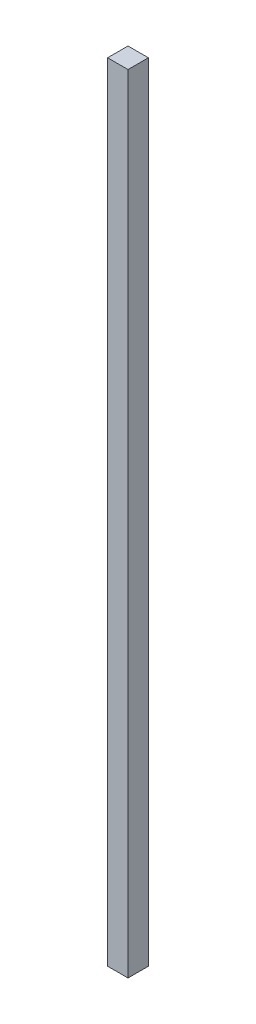
ISO-10303-21;
HEADER;
FILE_DESCRIPTION(('STEP AP214'),'2;1');
FILE_NAME('part.step','',(''),(''),'','','');
FILE_SCHEMA(('AUTOMOTIVE_DESIGN { 1 0 10303 214 1 1 1 1 }'));
ENDSEC;
DATA;
#1=APPLICATION_CONTEXT('core data for automotive mechanical design processes');
#2=APPLICATION_PROTOCOL_DEFINITION('international standard','automotive_design',2000,#1);
#3=PRODUCT_CONTEXT('',#1,'mechanical');
#4=PRODUCT('Part','Part','',(#3));
#5=PRODUCT_RELATED_PRODUCT_CATEGORY('part','',(#4));
#6=PRODUCT_DEFINITION_FORMATION('','',#4);
#7=PRODUCT_DEFINITION_CONTEXT('part definition',#1,'design');
#8=PRODUCT_DEFINITION('design','',#6,#7);
#9=PRODUCT_DEFINITION_SHAPE('','',#8);
#10=(LENGTH_UNIT() NAMED_UNIT(*) SI_UNIT(.MILLI.,.METRE.));
#11=(NAMED_UNIT(*) PLANE_ANGLE_UNIT() SI_UNIT($,.RADIAN.));
#12=(NAMED_UNIT(*) SI_UNIT($,.STERADIAN.) SOLID_ANGLE_UNIT());
#13=UNCERTAINTY_MEASURE_WITH_UNIT(LENGTH_MEASURE(1.E-05),#10,'distance_accuracy_value','');
#14=(GEOMETRIC_REPRESENTATION_CONTEXT(3) GLOBAL_UNCERTAINTY_ASSIGNED_CONTEXT((#13)) GLOBAL_UNIT_ASSIGNED_CONTEXT((#10,
#11,#12)) REPRESENTATION_CONTEXT('',''));
#15=CARTESIAN_POINT('',(0.,0.,0.));
#16=DIRECTION('',(0.,0.,1.));
#17=DIRECTION('',(1.,0.,0.));
#18=AXIS2_PLACEMENT_3D('',#15,#16,#17);
#19=CARTESIAN_POINT('',(0.,463.,0.));
#20=DIRECTION('',(1.,0.,0.));
#21=DIRECTION('',(0.,0.,-1.));
#22=AXIS2_PLACEMENT_3D('',#19,#20,#21);
#23=PLANE('',#22);
#24=DIRECTION('',(0.,0.,1.));
#25=VECTOR('',#24,1.);
#26=CARTESIAN_POINT('',(0.,0.,0.));
#27=LINE('',#26,#25);
#28=CARTESIAN_POINT('',(0.,0.,-12.));
#29=VERTEX_POINT('',#28);
#30=CARTESIAN_POINT('',(0.,0.,0.));
#31=VERTEX_POINT('',#30);
#32=EDGE_CURVE('E96',#29,#31,#27,.T.);
#33=ORIENTED_EDGE('',*,*,#32,.T.);
#34=DIRECTION('',(0.,-1.,0.));
#35=VECTOR('',#34,1.);
#36=CARTESIAN_POINT('',(0.,463.,0.));
#37=LINE('',#36,#35);
#38=CARTESIAN_POINT('',(0.,463.,0.));
#39=VERTEX_POINT('',#38);
#40=EDGE_CURVE('E11',#39,#31,#37,.T.);
#41=ORIENTED_EDGE('',*,*,#40,.F.);
#42=DIRECTION('',(0.,0.,1.));
#43=VECTOR('',#42,1.);
#44=CARTESIAN_POINT('',(0.,463.,0.));
#45=LINE('',#44,#43);
#46=CARTESIAN_POINT('',(0.,463.,-12.));
#47=VERTEX_POINT('',#46);
#48=EDGE_CURVE('E84',#47,#39,#45,.T.);
#49=ORIENTED_EDGE('',*,*,#48,.F.);
#50=DIRECTION('',(0.,-1.,0.));
#51=VECTOR('',#50,1.);
#52=CARTESIAN_POINT('',(0.,463.,-12.));
#53=LINE('',#52,#51);
#54=EDGE_CURVE('E92',#47,#29,#53,.T.);
#55=ORIENTED_EDGE('',*,*,#54,.T.);
#56=EDGE_LOOP('',(#33,#41,#49,#55));
#57=FACE_BOUND('',#56,.T.);
#58=ADVANCED_FACE('F33',(#57),#23,.F.);
#59=CARTESIAN_POINT('',(0.,463.,0.));
#60=DIRECTION('',(0.,0.,-1.));
#61=DIRECTION('',(-1.,0.,0.));
#62=AXIS2_PLACEMENT_3D('',#59,#60,#61);
#63=PLANE('',#62);
#64=DIRECTION('',(1.,0.,0.));
#65=VECTOR('',#64,1.);
#66=CARTESIAN_POINT('',(0.,0.,0.));
#67=LINE('',#66,#65);
#68=CARTESIAN_POINT('',(12.,0.,0.));
#69=VERTEX_POINT('',#68);
#70=EDGE_CURVE('E88',#31,#69,#67,.T.);
#71=ORIENTED_EDGE('',*,*,#70,.T.);
#72=DIRECTION('',(0.,-1.,0.));
#73=VECTOR('',#72,1.);
#74=CARTESIAN_POINT('',(12.,463.,0.));
#75=LINE('',#74,#73);
#76=CARTESIAN_POINT('',(12.,463.,0.));
#77=VERTEX_POINT('',#76);
#78=EDGE_CURVE('E41',#77,#69,#75,.T.);
#79=ORIENTED_EDGE('',*,*,#78,.F.);
#80=DIRECTION('',(1.,0.,0.));
#81=VECTOR('',#80,1.);
#82=CARTESIAN_POINT('',(0.,463.,0.));
#83=LINE('',#82,#81);
#84=EDGE_CURVE('E79',#39,#77,#83,.T.);
#85=ORIENTED_EDGE('',*,*,#84,.F.);
#86=ORIENTED_EDGE('',*,*,#40,.T.);
#87=EDGE_LOOP('',(#71,#79,#85,#86));
#88=FACE_BOUND('',#87,.T.);
#89=ADVANCED_FACE('F87',(#88),#63,.F.);
#90=CARTESIAN_POINT('',(12.,463.,0.));
#91=DIRECTION('',(-1.,0.,0.));
#92=DIRECTION('',(0.,0.,1.));
#93=AXIS2_PLACEMENT_3D('',#90,#91,#92);
#94=PLANE('',#93);
#95=DIRECTION('',(0.,0.,-1.));
#96=VECTOR('',#95,1.);
#97=CARTESIAN_POINT('',(12.,0.,0.));
#98=LINE('',#97,#96);
#99=CARTESIAN_POINT('',(12.,0.,-12.));
#100=VERTEX_POINT('',#99);
#101=EDGE_CURVE('E66',#69,#100,#98,.T.);
#102=ORIENTED_EDGE('',*,*,#101,.T.);
#103=DIRECTION('',(0.,-1.,0.));
#104=VECTOR('',#103,1.);
#105=CARTESIAN_POINT('',(12.,463.,-12.));
#106=LINE('',#105,#104);
#107=CARTESIAN_POINT('',(12.,463.,-12.));
#108=VERTEX_POINT('',#107);
#109=EDGE_CURVE('E89',#108,#100,#106,.T.);
#110=ORIENTED_EDGE('',*,*,#109,.F.);
#111=DIRECTION('',(0.,0.,-1.));
#112=VECTOR('',#111,1.);
#113=CARTESIAN_POINT('',(12.,463.,0.));
#114=LINE('',#113,#112);
#115=EDGE_CURVE('E82',#77,#108,#114,.T.);
#116=ORIENTED_EDGE('',*,*,#115,.F.);
#117=ORIENTED_EDGE('',*,*,#78,.T.);
#118=EDGE_LOOP('',(#102,#110,#116,#117));
#119=FACE_BOUND('',#118,.T.);
#120=ADVANCED_FACE('F90',(#119),#94,.F.);
#121=CARTESIAN_POINT('',(0.,463.,-12.));
#122=DIRECTION('',(0.,0.,1.));
#123=DIRECTION('',(1.,0.,0.));
#124=AXIS2_PLACEMENT_3D('',#121,#122,#123);
#125=PLANE('',#124);
#126=DIRECTION('',(-1.,0.,0.));
#127=VECTOR('',#126,1.);
#128=CARTESIAN_POINT('',(0.,0.,-12.));
#129=LINE('',#128,#127);
#130=EDGE_CURVE('E72',#100,#29,#129,.T.);
#131=ORIENTED_EDGE('',*,*,#130,.T.);
#132=ORIENTED_EDGE('',*,*,#54,.F.);
#133=DIRECTION('',(-1.,0.,0.));
#134=VECTOR('',#133,1.);
#135=CARTESIAN_POINT('',(0.,463.,-12.));
#136=LINE('',#135,#134);
#137=EDGE_CURVE('E49',#108,#47,#136,.T.);
#138=ORIENTED_EDGE('',*,*,#137,.F.);
#139=ORIENTED_EDGE('',*,*,#109,.T.);
#140=EDGE_LOOP('',(#131,#132,#138,#139));
#141=FACE_BOUND('',#140,.T.);
#142=ADVANCED_FACE('F103',(#141),#125,.F.);
#143=CARTESIAN_POINT('',(0.,463.,0.));
#144=DIRECTION('',(0.,-1.,0.));
#145=DIRECTION('',(0.,0.,-1.));
#146=AXIS2_PLACEMENT_3D('',#143,#144,#145);
#147=PLANE('',#146);
#148=ORIENTED_EDGE('',*,*,#48,.T.);
#149=ORIENTED_EDGE('',*,*,#84,.T.);
#150=ORIENTED_EDGE('',*,*,#115,.T.);
#151=ORIENTED_EDGE('',*,*,#137,.T.);
#152=EDGE_LOOP('',(#148,#149,#150,#151));
#153=FACE_BOUND('',#152,.T.);
#154=ADVANCED_FACE('F80',(#153),#147,.F.);
#155=CARTESIAN_POINT('',(0.,0.,0.));
#156=DIRECTION('',(0.,-1.,0.));
#157=DIRECTION('',(0.,0.,-1.));
#158=AXIS2_PLACEMENT_3D('',#155,#156,#157);
#159=PLANE('',#158);
#160=ORIENTED_EDGE('',*,*,#32,.F.);
#161=ORIENTED_EDGE('',*,*,#130,.F.);
#162=ORIENTED_EDGE('',*,*,#101,.F.);
#163=ORIENTED_EDGE('',*,*,#70,.F.);
#164=EDGE_LOOP('',(#160,#161,#162,#163));
#165=FACE_BOUND('',#164,.T.);
#166=ADVANCED_FACE('F106',(#165),#159,.T.);
#167=CLOSED_SHELL('',(#58,#89,#120,#142,#154,#166));
#168=MANIFOLD_SOLID_BREP('B2',#167);
#169=ADVANCED_BREP_SHAPE_REPRESENTATION('',(#18,#168),#14);
#170=SHAPE_DEFINITION_REPRESENTATION(#9,#169);
ENDSEC;
END-ISO-10303-21;
